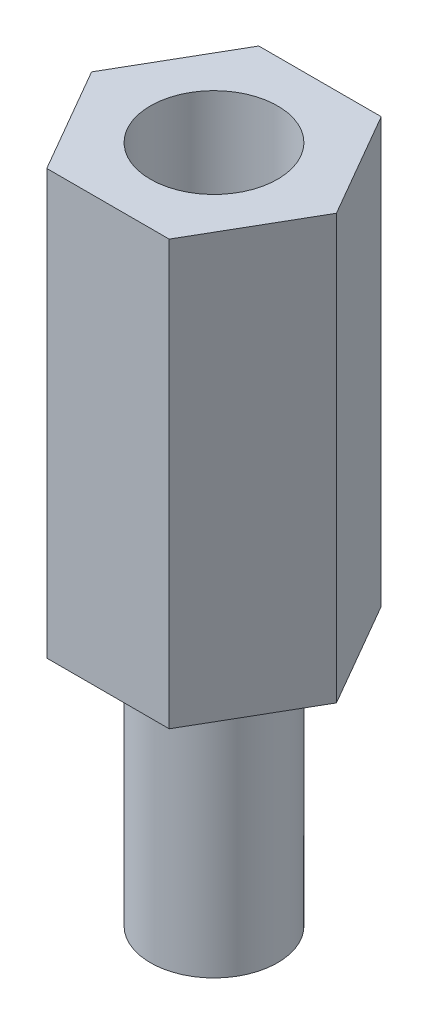
ISO-10303-21;
HEADER;
FILE_DESCRIPTION(('STEP AP214'),'2;1');
FILE_NAME('part.step','',(''),(''),'','','');
FILE_SCHEMA(('AUTOMOTIVE_DESIGN { 1 0 10303 214 1 1 1 1 }'));
ENDSEC;
DATA;
#1=APPLICATION_CONTEXT('core data for automotive mechanical design processes');
#2=APPLICATION_PROTOCOL_DEFINITION('international standard','automotive_design',2000,#1);
#3=PRODUCT_CONTEXT('',#1,'mechanical');
#4=PRODUCT('Part','Part','',(#3));
#5=PRODUCT_RELATED_PRODUCT_CATEGORY('part','',(#4));
#6=PRODUCT_DEFINITION_FORMATION('','',#4);
#7=PRODUCT_DEFINITION_CONTEXT('part definition',#1,'design');
#8=PRODUCT_DEFINITION('design','',#6,#7);
#9=PRODUCT_DEFINITION_SHAPE('','',#8);
#10=(LENGTH_UNIT() NAMED_UNIT(*) SI_UNIT(.MILLI.,.METRE.));
#11=(NAMED_UNIT(*) PLANE_ANGLE_UNIT() SI_UNIT($,.RADIAN.));
#12=(NAMED_UNIT(*) SI_UNIT($,.STERADIAN.) SOLID_ANGLE_UNIT());
#13=UNCERTAINTY_MEASURE_WITH_UNIT(LENGTH_MEASURE(1.E-05),#10,'distance_accuracy_value','');
#14=(GEOMETRIC_REPRESENTATION_CONTEXT(3) GLOBAL_UNCERTAINTY_ASSIGNED_CONTEXT((#13)) GLOBAL_UNIT_ASSIGNED_CONTEXT((#10,
#11,#12)) REPRESENTATION_CONTEXT('',''));
#15=CARTESIAN_POINT('',(0.,0.,0.));
#16=DIRECTION('',(0.,0.,1.));
#17=DIRECTION('',(1.,0.,0.));
#18=AXIS2_PLACEMENT_3D('',#15,#16,#17);
#19=CARTESIAN_POINT('',(0.,-6.,0.));
#20=DIRECTION('',(0.,1.,0.));
#21=DIRECTION('',(0.,0.,1.));
#22=AXIS2_PLACEMENT_3D('',#19,#20,#21);
#23=CYLINDRICAL_SURFACE('',#22,1.5);
#24=CARTESIAN_POINT('',(0.,-6.,0.));
#25=DIRECTION('',(0.,-1.,0.));
#26=DIRECTION('',(0.,0.,-1.));
#27=AXIS2_PLACEMENT_3D('',#24,#25,#26);
#28=CIRCLE('',#27,1.5);
#29=CARTESIAN_POINT('',(0.,-6.,-1.5));
#30=VERTEX_POINT('',#29);
#31=EDGE_CURVE('E11',#30,#30,#28,.T.);
#32=ORIENTED_EDGE('',*,*,#31,.F.);
#33=EDGE_LOOP('',(#32));
#34=FACE_BOUND('',#33,.T.);
#35=CARTESIAN_POINT('',(0.,0.,0.));
#36=DIRECTION('',(0.,-1.,0.));
#37=DIRECTION('',(0.,0.,-1.));
#38=AXIS2_PLACEMENT_3D('',#35,#36,#37);
#39=CIRCLE('',#38,1.5);
#40=CARTESIAN_POINT('',(0.,0.,-1.5));
#41=VERTEX_POINT('',#40);
#42=EDGE_CURVE('E44',#41,#41,#39,.T.);
#43=ORIENTED_EDGE('',*,*,#42,.T.);
#44=EDGE_LOOP('',(#43));
#45=FACE_BOUND('',#44,.T.);
#46=ADVANCED_FACE('F41',(#34,#45),#23,.T.);
#47=CARTESIAN_POINT('',(0.,-6.,0.));
#48=DIRECTION('',(0.,-1.,0.));
#49=DIRECTION('',(0.,0.,-1.));
#50=AXIS2_PLACEMENT_3D('',#47,#48,#49);
#51=PLANE('',#50);
#52=ORIENTED_EDGE('',*,*,#31,.T.);
#53=EDGE_LOOP('',(#52));
#54=FACE_BOUND('',#53,.T.);
#55=ADVANCED_FACE('F56',(#54),#51,.T.);
#56=CARTESIAN_POINT('',(0.,0.,0.));
#57=DIRECTION('',(0.,-1.,0.));
#58=DIRECTION('',(0.,0.,-1.));
#59=AXIS2_PLACEMENT_3D('',#56,#57,#58);
#60=PLANE('',#59);
#61=ORIENTED_EDGE('',*,*,#42,.F.);
#62=EDGE_LOOP('',(#61));
#63=FACE_BOUND('',#62,.T.);
#64=ADVANCED_FACE('F54',(#63),#60,.F.);
#65=CLOSED_SHELL('',(#46,#55,#64));
#66=MANIFOLD_SOLID_BREP('B2',#65);
#67=CARTESIAN_POINT('',(0.,10.,0.));
#68=DIRECTION('',(0.,1.,0.));
#69=DIRECTION('',(0.,0.,1.));
#70=AXIS2_PLACEMENT_3D('',#67,#68,#69);
#71=PLANE('',#70);
#72=DIRECTION('',(1.,0.,0.));
#73=VECTOR('',#72,1.);
#74=CARTESIAN_POINT('',(-1.44337567297405,10.,2.5));
#75=LINE('',#74,#73);
#76=CARTESIAN_POINT('',(-1.44337567297405,10.,2.5));
#77=VERTEX_POINT('',#76);
#78=CARTESIAN_POINT('',(1.44337567297408,10.,2.5));
#79=VERTEX_POINT('',#78);
#80=EDGE_CURVE('E178',#77,#79,#75,.T.);
#81=ORIENTED_EDGE('',*,*,#80,.T.);
#82=DIRECTION('',(0.500000000000001,0.,-0.866025403784438));
#83=VECTOR('',#82,1.);
#84=CARTESIAN_POINT('',(1.44337567297408,10.,2.5));
#85=LINE('',#84,#83);
#86=CARTESIAN_POINT('',(2.88675134594815,10.,0.));
#87=VERTEX_POINT('',#86);
#88=EDGE_CURVE('E136',#79,#87,#85,.T.);
#89=ORIENTED_EDGE('',*,*,#88,.T.);
#90=DIRECTION('',(-0.500000000000001,0.,-0.866025403784438));
#91=VECTOR('',#90,1.);
#92=CARTESIAN_POINT('',(2.88675134594815,10.,0.));
#93=LINE('',#92,#91);
#94=CARTESIAN_POINT('',(1.44337567297408,10.,-2.50000000000001));
#95=VERTEX_POINT('',#94);
#96=EDGE_CURVE('E149',#87,#95,#93,.T.);
#97=ORIENTED_EDGE('',*,*,#96,.T.);
#98=DIRECTION('',(-1.,0.,0.));
#99=VECTOR('',#98,1.);
#100=CARTESIAN_POINT('',(1.44337567297408,10.,-2.50000000000001));
#101=LINE('',#100,#99);
#102=CARTESIAN_POINT('',(-1.44337567297405,10.,-2.50000000000001));
#103=VERTEX_POINT('',#102);
#104=EDGE_CURVE('E143',#95,#103,#101,.T.);
#105=ORIENTED_EDGE('',*,*,#104,.T.);
#106=DIRECTION('',(-0.5,0.,0.866025403784438));
#107=VECTOR('',#106,1.);
#108=CARTESIAN_POINT('',(-1.44337567297405,10.,-2.50000000000001));
#109=LINE('',#108,#107);
#110=CARTESIAN_POINT('',(-2.88675134594812,10.,0.));
#111=VERTEX_POINT('',#110);
#112=EDGE_CURVE('E147',#103,#111,#109,.T.);
#113=ORIENTED_EDGE('',*,*,#112,.T.);
#114=DIRECTION('',(0.5,0.,0.866025403784438));
#115=VECTOR('',#114,1.);
#116=CARTESIAN_POINT('',(-2.88675134594812,10.,0.));
#117=LINE('',#116,#115);
#118=EDGE_CURVE('E99',#111,#77,#117,.T.);
#119=ORIENTED_EDGE('',*,*,#118,.T.);
#120=EDGE_LOOP('',(#81,#89,#97,#105,#113,#119));
#121=FACE_BOUND('',#120,.T.);
#122=CARTESIAN_POINT('',(0.,10.,0.));
#123=DIRECTION('',(0.,1.,0.));
#124=DIRECTION('',(0.,0.,1.));
#125=AXIS2_PLACEMENT_3D('',#122,#123,#124);
#126=CIRCLE('',#125,1.5);
#127=CARTESIAN_POINT('',(0.,10.,1.5));
#128=VERTEX_POINT('',#127);
#129=EDGE_CURVE('E171',#128,#128,#126,.T.);
#130=ORIENTED_EDGE('',*,*,#129,.F.);
#131=EDGE_LOOP('',(#130));
#132=FACE_BOUND('',#131,.T.);
#133=ADVANCED_FACE('F82',(#121,#132),#71,.T.);
#134=CARTESIAN_POINT('',(0.,0.,0.));
#135=DIRECTION('',(0.,1.,0.));
#136=DIRECTION('',(0.,0.,1.));
#137=AXIS2_PLACEMENT_3D('',#134,#135,#136);
#138=PLANE('',#137);
#139=DIRECTION('',(1.,0.,0.));
#140=VECTOR('',#139,1.);
#141=CARTESIAN_POINT('',(-1.44337567297405,0.,2.5));
#142=LINE('',#141,#140);
#143=CARTESIAN_POINT('',(-1.44337567297405,0.,2.5));
#144=VERTEX_POINT('',#143);
#145=CARTESIAN_POINT('',(1.44337567297408,0.,2.5));
#146=VERTEX_POINT('',#145);
#147=EDGE_CURVE('E167',#144,#146,#142,.T.);
#148=ORIENTED_EDGE('',*,*,#147,.F.);
#149=DIRECTION('',(0.5,0.,0.866025403784438));
#150=VECTOR('',#149,1.);
#151=CARTESIAN_POINT('',(-2.88675134594812,0.,0.));
#152=LINE('',#151,#150);
#153=CARTESIAN_POINT('',(-2.88675134594812,0.,0.));
#154=VERTEX_POINT('',#153);
#155=EDGE_CURVE('E128',#154,#144,#152,.T.);
#156=ORIENTED_EDGE('',*,*,#155,.F.);
#157=DIRECTION('',(-0.5,0.,0.866025403784438));
#158=VECTOR('',#157,1.);
#159=CARTESIAN_POINT('',(-1.44337567297405,0.,-2.50000000000001));
#160=LINE('',#159,#158);
#161=CARTESIAN_POINT('',(-1.44337567297405,0.,-2.50000000000001));
#162=VERTEX_POINT('',#161);
#163=EDGE_CURVE('E122',#162,#154,#160,.T.);
#164=ORIENTED_EDGE('',*,*,#163,.F.);
#165=DIRECTION('',(-1.,0.,0.));
#166=VECTOR('',#165,1.);
#167=CARTESIAN_POINT('',(1.44337567297408,0.,-2.50000000000001));
#168=LINE('',#167,#166);
#169=CARTESIAN_POINT('',(1.44337567297408,0.,-2.50000000000001));
#170=VERTEX_POINT('',#169);
#171=EDGE_CURVE('E157',#170,#162,#168,.T.);
#172=ORIENTED_EDGE('',*,*,#171,.F.);
#173=DIRECTION('',(-0.500000000000001,0.,-0.866025403784438));
#174=VECTOR('',#173,1.);
#175=CARTESIAN_POINT('',(2.88675134594815,0.,0.));
#176=LINE('',#175,#174);
#177=CARTESIAN_POINT('',(2.88675134594815,0.,0.));
#178=VERTEX_POINT('',#177);
#179=EDGE_CURVE('E173',#178,#170,#176,.T.);
#180=ORIENTED_EDGE('',*,*,#179,.F.);
#181=DIRECTION('',(0.500000000000001,0.,-0.866025403784438));
#182=VECTOR('',#181,1.);
#183=CARTESIAN_POINT('',(1.44337567297408,0.,2.5));
#184=LINE('',#183,#182);
#185=EDGE_CURVE('E170',#146,#178,#184,.T.);
#186=ORIENTED_EDGE('',*,*,#185,.F.);
#187=EDGE_LOOP('',(#148,#156,#164,#172,#180,#186));
#188=FACE_BOUND('',#187,.T.);
#189=CARTESIAN_POINT('',(0.,0.,0.));
#190=DIRECTION('',(0.,1.,0.));
#191=DIRECTION('',(0.,0.,1.));
#192=AXIS2_PLACEMENT_3D('',#189,#190,#191);
#193=CIRCLE('',#192,1.5);
#194=CARTESIAN_POINT('',(0.,0.,1.5));
#195=VERTEX_POINT('',#194);
#196=EDGE_CURVE('E271',#195,#195,#193,.T.);
#197=ORIENTED_EDGE('',*,*,#196,.T.);
#198=EDGE_LOOP('',(#197));
#199=FACE_BOUND('',#198,.T.);
#200=ADVANCED_FACE('F187',(#188,#199),#138,.F.);
#201=CARTESIAN_POINT('',(-1.44337567297405,10.,2.5));
#202=DIRECTION('',(0.,0.,-1.));
#203=DIRECTION('',(-1.,0.,0.));
#204=AXIS2_PLACEMENT_3D('',#201,#202,#203);
#205=PLANE('',#204);
#206=ORIENTED_EDGE('',*,*,#147,.T.);
#207=DIRECTION('',(0.,-1.,0.));
#208=VECTOR('',#207,1.);
#209=CARTESIAN_POINT('',(1.44337567297408,10.,2.5));
#210=LINE('',#209,#208);
#211=EDGE_CURVE('E39',#79,#146,#210,.T.);
#212=ORIENTED_EDGE('',*,*,#211,.F.);
#213=ORIENTED_EDGE('',*,*,#80,.F.);
#214=DIRECTION('',(0.,-1.,0.));
#215=VECTOR('',#214,1.);
#216=CARTESIAN_POINT('',(-1.44337567297405,10.,2.5));
#217=LINE('',#216,#215);
#218=EDGE_CURVE('E163',#77,#144,#217,.T.);
#219=ORIENTED_EDGE('',*,*,#218,.T.);
#220=EDGE_LOOP('',(#206,#212,#213,#219));
#221=FACE_BOUND('',#220,.T.);
#222=ADVANCED_FACE('F84',(#221),#205,.F.);
#223=CARTESIAN_POINT('',(1.44337567297408,10.,2.5));
#224=DIRECTION('',(-0.866025403784438,0.,-0.500000000000001));
#225=DIRECTION('',(-0.500000000000001,0.,0.866025403784438));
#226=AXIS2_PLACEMENT_3D('',#223,#224,#225);
#227=PLANE('',#226);
#228=ORIENTED_EDGE('',*,*,#185,.T.);
#229=DIRECTION('',(0.,-1.,0.));
#230=VECTOR('',#229,1.);
#231=CARTESIAN_POINT('',(2.88675134594815,10.,0.));
#232=LINE('',#231,#230);
#233=EDGE_CURVE('E91',#87,#178,#232,.T.);
#234=ORIENTED_EDGE('',*,*,#233,.F.);
#235=ORIENTED_EDGE('',*,*,#88,.F.);
#236=ORIENTED_EDGE('',*,*,#211,.T.);
#237=EDGE_LOOP('',(#228,#234,#235,#236));
#238=FACE_BOUND('',#237,.T.);
#239=ADVANCED_FACE('F212',(#238),#227,.F.);
#240=CARTESIAN_POINT('',(2.88675134594815,10.,0.));
#241=DIRECTION('',(-0.866025403784438,0.,0.500000000000001));
#242=DIRECTION('',(0.500000000000001,0.,0.866025403784438));
#243=AXIS2_PLACEMENT_3D('',#240,#241,#242);
#244=PLANE('',#243);
#245=ORIENTED_EDGE('',*,*,#179,.T.);
#246=DIRECTION('',(0.,-1.,0.));
#247=VECTOR('',#246,1.);
#248=CARTESIAN_POINT('',(1.44337567297408,10.,-2.50000000000001));
#249=LINE('',#248,#247);
#250=EDGE_CURVE('E158',#95,#170,#249,.T.);
#251=ORIENTED_EDGE('',*,*,#250,.F.);
#252=ORIENTED_EDGE('',*,*,#96,.F.);
#253=ORIENTED_EDGE('',*,*,#233,.T.);
#254=EDGE_LOOP('',(#245,#251,#252,#253));
#255=FACE_BOUND('',#254,.T.);
#256=ADVANCED_FACE('F184',(#255),#244,.F.);
#257=CARTESIAN_POINT('',(1.44337567297408,10.,-2.50000000000001));
#258=DIRECTION('',(0.,0.,1.));
#259=DIRECTION('',(1.,0.,0.));
#260=AXIS2_PLACEMENT_3D('',#257,#258,#259);
#261=PLANE('',#260);
#262=ORIENTED_EDGE('',*,*,#171,.T.);
#263=DIRECTION('',(0.,-1.,0.));
#264=VECTOR('',#263,1.);
#265=CARTESIAN_POINT('',(-1.44337567297405,10.,-2.50000000000001));
#266=LINE('',#265,#264);
#267=EDGE_CURVE('E154',#103,#162,#266,.T.);
#268=ORIENTED_EDGE('',*,*,#267,.F.);
#269=ORIENTED_EDGE('',*,*,#104,.F.);
#270=ORIENTED_EDGE('',*,*,#250,.T.);
#271=EDGE_LOOP('',(#262,#268,#269,#270));
#272=FACE_BOUND('',#271,.T.);
#273=ADVANCED_FACE('F155',(#272),#261,.F.);
#274=CARTESIAN_POINT('',(-1.44337567297405,10.,-2.50000000000001));
#275=DIRECTION('',(0.866025403784439,0.,0.5));
#276=DIRECTION('',(0.5,0.,-0.866025403784439));
#277=AXIS2_PLACEMENT_3D('',#274,#275,#276);
#278=PLANE('',#277);
#279=ORIENTED_EDGE('',*,*,#163,.T.);
#280=DIRECTION('',(0.,-1.,0.));
#281=VECTOR('',#280,1.);
#282=CARTESIAN_POINT('',(-2.88675134594812,10.,0.));
#283=LINE('',#282,#281);
#284=EDGE_CURVE('E159',#111,#154,#283,.T.);
#285=ORIENTED_EDGE('',*,*,#284,.F.);
#286=ORIENTED_EDGE('',*,*,#112,.F.);
#287=ORIENTED_EDGE('',*,*,#267,.T.);
#288=EDGE_LOOP('',(#279,#285,#286,#287));
#289=FACE_BOUND('',#288,.T.);
#290=ADVANCED_FACE('F161',(#289),#278,.F.);
#291=CARTESIAN_POINT('',(-2.88675134594812,10.,0.));
#292=DIRECTION('',(0.866025403784438,0.,-0.5));
#293=DIRECTION('',(-0.5,0.,-0.866025403784438));
#294=AXIS2_PLACEMENT_3D('',#291,#292,#293);
#295=PLANE('',#294);
#296=ORIENTED_EDGE('',*,*,#155,.T.);
#297=ORIENTED_EDGE('',*,*,#218,.F.);
#298=ORIENTED_EDGE('',*,*,#118,.F.);
#299=ORIENTED_EDGE('',*,*,#284,.T.);
#300=EDGE_LOOP('',(#296,#297,#298,#299));
#301=FACE_BOUND('',#300,.T.);
#302=ADVANCED_FACE('F192',(#301),#295,.F.);
#303=CARTESIAN_POINT('',(0.,10.,0.));
#304=DIRECTION('',(0.,-1.,0.));
#305=DIRECTION('',(0.,0.,-1.));
#306=AXIS2_PLACEMENT_3D('',#303,#304,#305);
#307=CYLINDRICAL_SURFACE('',#306,1.5);
#308=ORIENTED_EDGE('',*,*,#129,.T.);
#309=EDGE_LOOP('',(#308));
#310=FACE_BOUND('',#309,.T.);
#311=ORIENTED_EDGE('',*,*,#196,.F.);
#312=EDGE_LOOP('',(#311));
#313=FACE_BOUND('',#312,.T.);
#314=ADVANCED_FACE('F194',(#310,#313),#307,.F.);
#315=CLOSED_SHELL('',(#133,#200,#222,#239,#256,#273,#290,#302,#314));
#316=MANIFOLD_SOLID_BREP('B6',#315);
#317=ADVANCED_BREP_SHAPE_REPRESENTATION('',(#18,#66,#316),#14);
#318=SHAPE_DEFINITION_REPRESENTATION(#9,#317);
ENDSEC;
END-ISO-10303-21;
